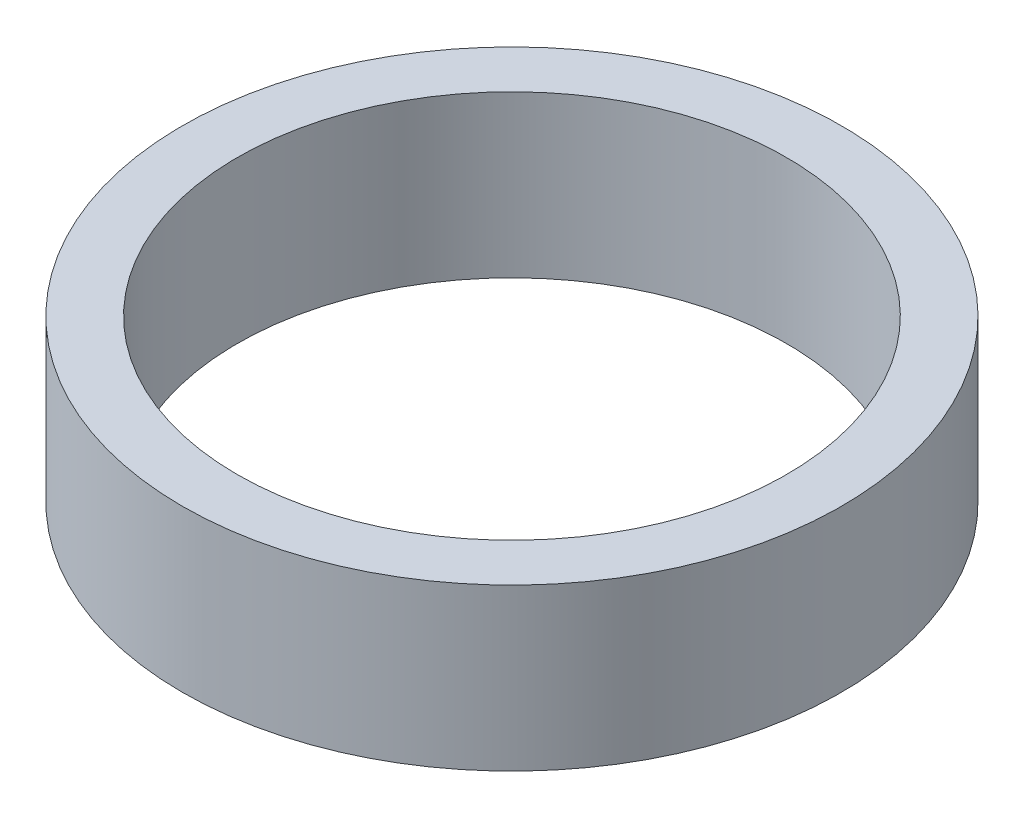
ISO-10303-21;
HEADER;
FILE_DESCRIPTION(('STEP AP214'),'2;1');
FILE_NAME('part.step','',(''),(''),'','','');
FILE_SCHEMA(('AUTOMOTIVE_DESIGN { 1 0 10303 214 1 1 1 1 }'));
ENDSEC;
DATA;
#1=APPLICATION_CONTEXT('core data for automotive mechanical design processes');
#2=APPLICATION_PROTOCOL_DEFINITION('international standard','automotive_design',2000,#1);
#3=PRODUCT_CONTEXT('',#1,'mechanical');
#4=PRODUCT('Part','Part','',(#3));
#5=PRODUCT_RELATED_PRODUCT_CATEGORY('part','',(#4));
#6=PRODUCT_DEFINITION_FORMATION('','',#4);
#7=PRODUCT_DEFINITION_CONTEXT('part definition',#1,'design');
#8=PRODUCT_DEFINITION('design','',#6,#7);
#9=PRODUCT_DEFINITION_SHAPE('','',#8);
#10=(LENGTH_UNIT() NAMED_UNIT(*) SI_UNIT(.MILLI.,.METRE.));
#11=(NAMED_UNIT(*) PLANE_ANGLE_UNIT() SI_UNIT($,.RADIAN.));
#12=(NAMED_UNIT(*) SI_UNIT($,.STERADIAN.) SOLID_ANGLE_UNIT());
#13=UNCERTAINTY_MEASURE_WITH_UNIT(LENGTH_MEASURE(1.E-05),#10,'distance_accuracy_value','');
#14=(GEOMETRIC_REPRESENTATION_CONTEXT(3) GLOBAL_UNCERTAINTY_ASSIGNED_CONTEXT((#13)) GLOBAL_UNIT_ASSIGNED_CONTEXT((#10,
#11,#12)) REPRESENTATION_CONTEXT('',''));
#15=CARTESIAN_POINT('',(0.,0.,0.));
#16=DIRECTION('',(0.,0.,1.));
#17=DIRECTION('',(1.,0.,0.));
#18=AXIS2_PLACEMENT_3D('',#15,#16,#17);
#19=CARTESIAN_POINT('',(0.,22.,0.));
#20=DIRECTION('',(0.,-1.,0.));
#21=DIRECTION('',(0.,0.,-1.));
#22=AXIS2_PLACEMENT_3D('',#19,#20,#21);
#23=CYLINDRICAL_SURFACE('',#22,45.);
#24=CARTESIAN_POINT('',(0.,22.,0.));
#25=DIRECTION('',(0.,1.,0.));
#26=DIRECTION('',(0.,0.,1.));
#27=AXIS2_PLACEMENT_3D('',#24,#25,#26);
#28=CIRCLE('',#27,45.);
#29=CARTESIAN_POINT('',(0.,22.,45.));
#30=VERTEX_POINT('',#29);
#31=EDGE_CURVE('E10',#30,#30,#28,.T.);
#32=ORIENTED_EDGE('',*,*,#31,.F.);
#33=EDGE_LOOP('',(#32));
#34=FACE_BOUND('',#33,.T.);
#35=CARTESIAN_POINT('',(0.,0.,0.));
#36=DIRECTION('',(0.,1.,0.));
#37=DIRECTION('',(0.,0.,1.));
#38=AXIS2_PLACEMENT_3D('',#35,#36,#37);
#39=CIRCLE('',#38,45.);
#40=CARTESIAN_POINT('',(0.,0.,45.));
#41=VERTEX_POINT('',#40);
#42=EDGE_CURVE('E37',#41,#41,#39,.T.);
#43=ORIENTED_EDGE('',*,*,#42,.T.);
#44=EDGE_LOOP('',(#43));
#45=FACE_BOUND('',#44,.T.);
#46=ADVANCED_FACE('F40',(#34,#45),#23,.T.);
#47=CARTESIAN_POINT('',(0.,22.,0.));
#48=DIRECTION('',(0.,1.,0.));
#49=DIRECTION('',(0.,0.,1.));
#50=AXIS2_PLACEMENT_3D('',#47,#48,#49);
#51=PLANE('',#50);
#52=CARTESIAN_POINT('',(0.,22.,0.));
#53=DIRECTION('',(0.,1.,0.));
#54=DIRECTION('',(0.,0.,1.));
#55=AXIS2_PLACEMENT_3D('',#52,#53,#54);
#56=CIRCLE('',#55,37.5);
#57=CARTESIAN_POINT('',(0.,22.,37.5));
#58=VERTEX_POINT('',#57);
#59=EDGE_CURVE('E50',#58,#58,#56,.T.);
#60=ORIENTED_EDGE('',*,*,#59,.F.);
#61=EDGE_LOOP('',(#60));
#62=FACE_BOUND('',#61,.T.);
#63=ORIENTED_EDGE('',*,*,#31,.T.);
#64=EDGE_LOOP('',(#63));
#65=FACE_BOUND('',#64,.T.);
#66=ADVANCED_FACE('F59',(#62,#65),#51,.T.);
#67=CARTESIAN_POINT('',(0.,0.,0.));
#68=DIRECTION('',(0.,1.,0.));
#69=DIRECTION('',(0.,0.,1.));
#70=AXIS2_PLACEMENT_3D('',#67,#68,#69);
#71=PLANE('',#70);
#72=CARTESIAN_POINT('',(0.,0.,0.));
#73=DIRECTION('',(0.,1.,0.));
#74=DIRECTION('',(0.,0.,1.));
#75=AXIS2_PLACEMENT_3D('',#72,#73,#74);
#76=CIRCLE('',#75,37.5);
#77=CARTESIAN_POINT('',(0.,0.,37.5));
#78=VERTEX_POINT('',#77);
#79=EDGE_CURVE('E47',#78,#78,#76,.T.);
#80=ORIENTED_EDGE('',*,*,#79,.T.);
#81=EDGE_LOOP('',(#80));
#82=FACE_BOUND('',#81,.T.);
#83=ORIENTED_EDGE('',*,*,#42,.F.);
#84=EDGE_LOOP('',(#83));
#85=FACE_BOUND('',#84,.T.);
#86=ADVANCED_FACE('F58',(#82,#85),#71,.F.);
#87=CARTESIAN_POINT('',(0.,22.,0.));
#88=DIRECTION('',(0.,-1.,0.));
#89=DIRECTION('',(0.,0.,-1.));
#90=AXIS2_PLACEMENT_3D('',#87,#88,#89);
#91=CYLINDRICAL_SURFACE('',#90,37.5);
#92=ORIENTED_EDGE('',*,*,#59,.T.);
#93=EDGE_LOOP('',(#92));
#94=FACE_BOUND('',#93,.T.);
#95=ORIENTED_EDGE('',*,*,#79,.F.);
#96=EDGE_LOOP('',(#95));
#97=FACE_BOUND('',#96,.T.);
#98=ADVANCED_FACE('F54',(#94,#97),#91,.F.);
#99=CLOSED_SHELL('',(#46,#66,#86,#98));
#100=MANIFOLD_SOLID_BREP('B2',#99);
#101=ADVANCED_BREP_SHAPE_REPRESENTATION('',(#18,#100),#14);
#102=SHAPE_DEFINITION_REPRESENTATION(#9,#101);
ENDSEC;
END-ISO-10303-21;
